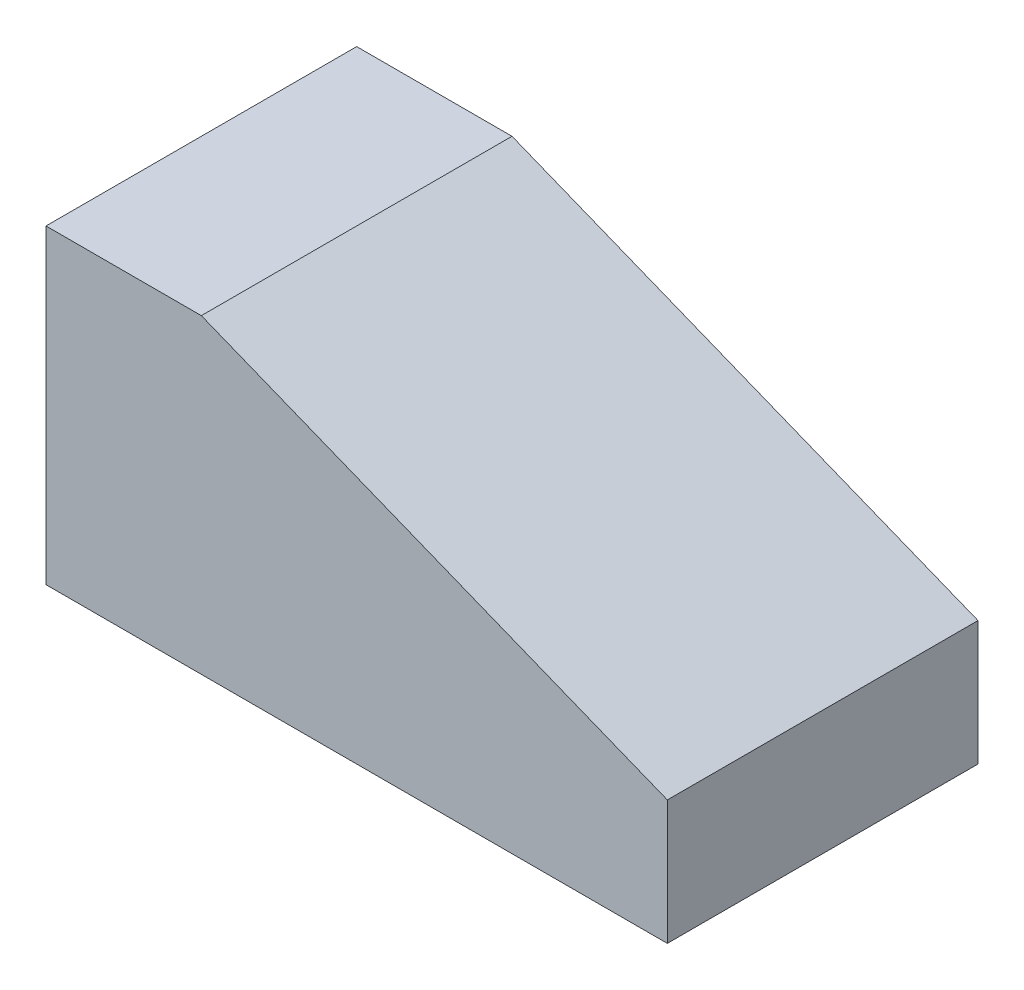
ISO-10303-21;
HEADER;
FILE_DESCRIPTION(('STEP AP214'),'2;1');
FILE_NAME('part.step','',(''),(''),'','','');
FILE_SCHEMA(('AUTOMOTIVE_DESIGN { 1 0 10303 214 1 1 1 1 }'));
ENDSEC;
DATA;
#1=APPLICATION_CONTEXT('core data for automotive mechanical design processes');
#2=APPLICATION_PROTOCOL_DEFINITION('international standard','automotive_design',2000,#1);
#3=PRODUCT_CONTEXT('',#1,'mechanical');
#4=PRODUCT('Part','Part','',(#3));
#5=PRODUCT_RELATED_PRODUCT_CATEGORY('part','',(#4));
#6=PRODUCT_DEFINITION_FORMATION('','',#4);
#7=PRODUCT_DEFINITION_CONTEXT('part definition',#1,'design');
#8=PRODUCT_DEFINITION('design','',#6,#7);
#9=PRODUCT_DEFINITION_SHAPE('','',#8);
#10=(LENGTH_UNIT() NAMED_UNIT(*) SI_UNIT(.MILLI.,.METRE.));
#11=(NAMED_UNIT(*) PLANE_ANGLE_UNIT() SI_UNIT($,.RADIAN.));
#12=(NAMED_UNIT(*) SI_UNIT($,.STERADIAN.) SOLID_ANGLE_UNIT());
#13=UNCERTAINTY_MEASURE_WITH_UNIT(LENGTH_MEASURE(1.E-05),#10,'distance_accuracy_value','');
#14=(GEOMETRIC_REPRESENTATION_CONTEXT(3) GLOBAL_UNCERTAINTY_ASSIGNED_CONTEXT((#13)) GLOBAL_UNIT_ASSIGNED_CONTEXT((#10,
#11,#12)) REPRESENTATION_CONTEXT('',''));
#15=CARTESIAN_POINT('',(0.,0.,0.));
#16=DIRECTION('',(0.,0.,1.));
#17=DIRECTION('',(1.,0.,0.));
#18=AXIS2_PLACEMENT_3D('',#15,#16,#17);
#19=CARTESIAN_POINT('',(0.,50.,50.));
#20=DIRECTION('',(1.,0.,0.));
#21=DIRECTION('',(0.,1.,0.));
#22=AXIS2_PLACEMENT_3D('',#19,#20,#21);
#23=PLANE('',#22);
#24=DIRECTION('',(0.,-1.,0.));
#25=VECTOR('',#24,1.);
#26=CARTESIAN_POINT('',(0.,50.,0.));
#27=LINE('',#26,#25);
#28=CARTESIAN_POINT('',(0.,50.,0.));
#29=VERTEX_POINT('',#28);
#30=CARTESIAN_POINT('',(0.,0.,0.));
#31=VERTEX_POINT('',#30);
#32=EDGE_CURVE('E107',#29,#31,#27,.T.);
#33=ORIENTED_EDGE('',*,*,#32,.T.);
#34=DIRECTION('',(0.,0.,-1.));
#35=VECTOR('',#34,1.);
#36=CARTESIAN_POINT('',(0.,0.,50.));
#37=LINE('',#36,#35);
#38=CARTESIAN_POINT('',(0.,0.,50.));
#39=VERTEX_POINT('',#38);
#40=EDGE_CURVE('E11',#39,#31,#37,.T.);
#41=ORIENTED_EDGE('',*,*,#40,.F.);
#42=DIRECTION('',(0.,-1.,0.));
#43=VECTOR('',#42,1.);
#44=CARTESIAN_POINT('',(0.,50.,50.));
#45=LINE('',#44,#43);
#46=CARTESIAN_POINT('',(0.,50.,50.));
#47=VERTEX_POINT('',#46);
#48=EDGE_CURVE('E115',#47,#39,#45,.T.);
#49=ORIENTED_EDGE('',*,*,#48,.F.);
#50=DIRECTION('',(0.,0.,-1.));
#51=VECTOR('',#50,1.);
#52=CARTESIAN_POINT('',(0.,50.,50.));
#53=LINE('',#52,#51);
#54=EDGE_CURVE('E103',#47,#29,#53,.T.);
#55=ORIENTED_EDGE('',*,*,#54,.T.);
#56=EDGE_LOOP('',(#33,#41,#49,#55));
#57=FACE_BOUND('',#56,.T.);
#58=ADVANCED_FACE('F33',(#57),#23,.F.);
#59=CARTESIAN_POINT('',(0.,0.,50.));
#60=DIRECTION('',(0.,1.,0.));
#61=DIRECTION('',(0.,0.,1.));
#62=AXIS2_PLACEMENT_3D('',#59,#60,#61);
#63=PLANE('',#62);
#64=DIRECTION('',(1.,0.,0.));
#65=VECTOR('',#64,1.);
#66=CARTESIAN_POINT('',(0.,0.,0.));
#67=LINE('',#66,#65);
#68=CARTESIAN_POINT('',(100.,0.,0.));
#69=VERTEX_POINT('',#68);
#70=EDGE_CURVE('E110',#31,#69,#67,.T.);
#71=ORIENTED_EDGE('',*,*,#70,.T.);
#72=DIRECTION('',(0.,0.,-1.));
#73=VECTOR('',#72,1.);
#74=CARTESIAN_POINT('',(100.,0.,50.));
#75=LINE('',#74,#73);
#76=CARTESIAN_POINT('',(100.,0.,50.));
#77=VERTEX_POINT('',#76);
#78=EDGE_CURVE('E41',#77,#69,#75,.T.);
#79=ORIENTED_EDGE('',*,*,#78,.F.);
#80=DIRECTION('',(1.,0.,0.));
#81=VECTOR('',#80,1.);
#82=CARTESIAN_POINT('',(0.,0.,50.));
#83=LINE('',#82,#81);
#84=EDGE_CURVE('E83',#39,#77,#83,.T.);
#85=ORIENTED_EDGE('',*,*,#84,.F.);
#86=ORIENTED_EDGE('',*,*,#40,.T.);
#87=EDGE_LOOP('',(#71,#79,#85,#86));
#88=FACE_BOUND('',#87,.T.);
#89=ADVANCED_FACE('F134',(#88),#63,.F.);
#90=CARTESIAN_POINT('',(100.,0.,50.));
#91=DIRECTION('',(-1.,0.,0.));
#92=DIRECTION('',(0.,0.,1.));
#93=AXIS2_PLACEMENT_3D('',#90,#91,#92);
#94=PLANE('',#93);
#95=DIRECTION('',(0.,1.,0.));
#96=VECTOR('',#95,1.);
#97=CARTESIAN_POINT('',(100.,0.,0.));
#98=LINE('',#97,#96);
#99=CARTESIAN_POINT('',(100.,20.,0.));
#100=VERTEX_POINT('',#99);
#101=EDGE_CURVE('E98',#69,#100,#98,.T.);
#102=ORIENTED_EDGE('',*,*,#101,.T.);
#103=DIRECTION('',(0.,0.,-1.));
#104=VECTOR('',#103,1.);
#105=CARTESIAN_POINT('',(100.,20.,50.));
#106=LINE('',#105,#104);
#107=CARTESIAN_POINT('',(100.,20.,50.));
#108=VERTEX_POINT('',#107);
#109=EDGE_CURVE('E95',#108,#100,#106,.T.);
#110=ORIENTED_EDGE('',*,*,#109,.F.);
#111=DIRECTION('',(0.,1.,0.));
#112=VECTOR('',#111,1.);
#113=CARTESIAN_POINT('',(100.,0.,50.));
#114=LINE('',#113,#112);
#115=EDGE_CURVE('E87',#77,#108,#114,.T.);
#116=ORIENTED_EDGE('',*,*,#115,.F.);
#117=ORIENTED_EDGE('',*,*,#78,.T.);
#118=EDGE_LOOP('',(#102,#110,#116,#117));
#119=FACE_BOUND('',#118,.T.);
#120=ADVANCED_FACE('F96',(#119),#94,.F.);
#121=CARTESIAN_POINT('',(100.,20.,50.));
#122=DIRECTION('',(-0.371390676354104,-0.928476690885259,0.));
#123=DIRECTION('',(0.928476690885259,-0.371390676354104,0.));
#124=AXIS2_PLACEMENT_3D('',#121,#122,#123);
#125=PLANE('',#124);
#126=DIRECTION('',(-0.928476690885259,0.371390676354104,0.));
#127=VECTOR('',#126,1.);
#128=CARTESIAN_POINT('',(100.,20.,0.));
#129=LINE('',#128,#127);
#130=CARTESIAN_POINT('',(25.,50.,0.));
#131=VERTEX_POINT('',#130);
#132=EDGE_CURVE('E69',#100,#131,#129,.T.);
#133=ORIENTED_EDGE('',*,*,#132,.T.);
#134=DIRECTION('',(0.,0.,-1.));
#135=VECTOR('',#134,1.);
#136=CARTESIAN_POINT('',(25.,50.,50.));
#137=LINE('',#136,#135);
#138=CARTESIAN_POINT('',(25.,50.,50.));
#139=VERTEX_POINT('',#138);
#140=EDGE_CURVE('E99',#139,#131,#137,.T.);
#141=ORIENTED_EDGE('',*,*,#140,.F.);
#142=DIRECTION('',(-0.928476690885259,0.371390676354104,0.));
#143=VECTOR('',#142,1.);
#144=CARTESIAN_POINT('',(100.,20.,50.));
#145=LINE('',#144,#143);
#146=EDGE_CURVE('E91',#108,#139,#145,.T.);
#147=ORIENTED_EDGE('',*,*,#146,.F.);
#148=ORIENTED_EDGE('',*,*,#109,.T.);
#149=EDGE_LOOP('',(#133,#141,#147,#148));
#150=FACE_BOUND('',#149,.T.);
#151=ADVANCED_FACE('F101',(#150),#125,.F.);
#152=CARTESIAN_POINT('',(25.,50.,50.));
#153=DIRECTION('',(0.,-1.,0.));
#154=DIRECTION('',(0.,0.,-1.));
#155=AXIS2_PLACEMENT_3D('',#152,#153,#154);
#156=PLANE('',#155);
#157=DIRECTION('',(-1.,0.,0.));
#158=VECTOR('',#157,1.);
#159=CARTESIAN_POINT('',(25.,50.,0.));
#160=LINE('',#159,#158);
#161=EDGE_CURVE('E75',#131,#29,#160,.T.);
#162=ORIENTED_EDGE('',*,*,#161,.T.);
#163=ORIENTED_EDGE('',*,*,#54,.F.);
#164=DIRECTION('',(-1.,0.,0.));
#165=VECTOR('',#164,1.);
#166=CARTESIAN_POINT('',(25.,50.,50.));
#167=LINE('',#166,#165);
#168=EDGE_CURVE('E49',#139,#47,#167,.T.);
#169=ORIENTED_EDGE('',*,*,#168,.F.);
#170=ORIENTED_EDGE('',*,*,#140,.T.);
#171=EDGE_LOOP('',(#162,#163,#169,#170));
#172=FACE_BOUND('',#171,.T.);
#173=ADVANCED_FACE('F123',(#172),#156,.F.);
#174=CARTESIAN_POINT('',(0.,0.,50.));
#175=DIRECTION('',(0.,0.,1.));
#176=DIRECTION('',(1.,0.,0.));
#177=AXIS2_PLACEMENT_3D('',#174,#175,#176);
#178=PLANE('',#177);
#179=ORIENTED_EDGE('',*,*,#48,.T.);
#180=ORIENTED_EDGE('',*,*,#84,.T.);
#181=ORIENTED_EDGE('',*,*,#115,.T.);
#182=ORIENTED_EDGE('',*,*,#146,.T.);
#183=ORIENTED_EDGE('',*,*,#168,.T.);
#184=EDGE_LOOP('',(#179,#180,#181,#182,#183));
#185=FACE_BOUND('',#184,.T.);
#186=ADVANCED_FACE('F89',(#185),#178,.T.);
#187=CARTESIAN_POINT('',(0.,0.,0.));
#188=DIRECTION('',(0.,0.,1.));
#189=DIRECTION('',(1.,0.,0.));
#190=AXIS2_PLACEMENT_3D('',#187,#188,#189);
#191=PLANE('',#190);
#192=ORIENTED_EDGE('',*,*,#32,.F.);
#193=ORIENTED_EDGE('',*,*,#161,.F.);
#194=ORIENTED_EDGE('',*,*,#132,.F.);
#195=ORIENTED_EDGE('',*,*,#101,.F.);
#196=ORIENTED_EDGE('',*,*,#70,.F.);
#197=EDGE_LOOP('',(#192,#193,#194,#195,#196));
#198=FACE_BOUND('',#197,.T.);
#199=ADVANCED_FACE('F119',(#198),#191,.F.);
#200=CLOSED_SHELL('',(#58,#89,#120,#151,#173,#186,#199));
#201=MANIFOLD_SOLID_BREP('B2',#200);
#202=ADVANCED_BREP_SHAPE_REPRESENTATION('',(#18,#201),#14);
#203=SHAPE_DEFINITION_REPRESENTATION(#9,#202);
ENDSEC;
END-ISO-10303-21;
